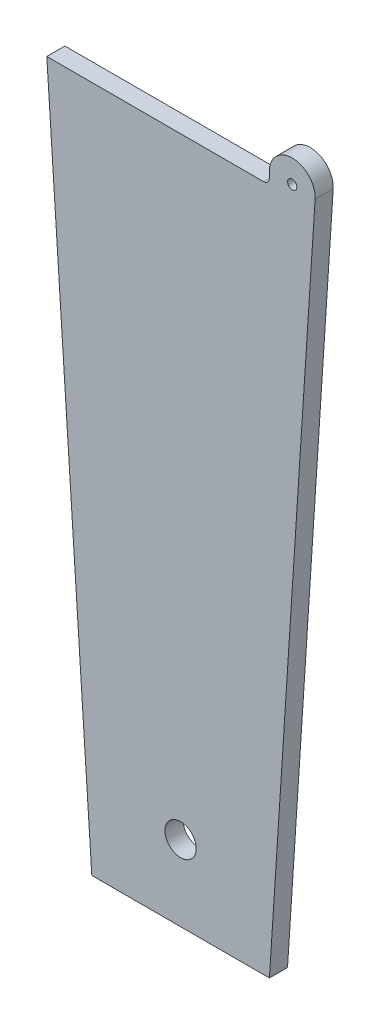
ISO-10303-21;
HEADER;
FILE_DESCRIPTION(('STEP AP214'),'2;1');
FILE_NAME('part.step','',(''),(''),'','','');
FILE_SCHEMA(('AUTOMOTIVE_DESIGN { 1 0 10303 214 1 1 1 1 }'));
ENDSEC;
DATA;
#1=APPLICATION_CONTEXT('core data for automotive mechanical design processes');
#2=APPLICATION_PROTOCOL_DEFINITION('international standard','automotive_design',2000,#1);
#3=PRODUCT_CONTEXT('',#1,'mechanical');
#4=PRODUCT('Part','Part','',(#3));
#5=PRODUCT_RELATED_PRODUCT_CATEGORY('part','',(#4));
#6=PRODUCT_DEFINITION_FORMATION('','',#4);
#7=PRODUCT_DEFINITION_CONTEXT('part definition',#1,'design');
#8=PRODUCT_DEFINITION('design','',#6,#7);
#9=PRODUCT_DEFINITION_SHAPE('','',#8);
#10=(LENGTH_UNIT() NAMED_UNIT(*) SI_UNIT(.MILLI.,.METRE.));
#11=(NAMED_UNIT(*) PLANE_ANGLE_UNIT() SI_UNIT($,.RADIAN.));
#12=(NAMED_UNIT(*) SI_UNIT($,.STERADIAN.) SOLID_ANGLE_UNIT());
#13=UNCERTAINTY_MEASURE_WITH_UNIT(LENGTH_MEASURE(1.E-05),#10,'distance_accuracy_value','');
#14=(GEOMETRIC_REPRESENTATION_CONTEXT(3) GLOBAL_UNCERTAINTY_ASSIGNED_CONTEXT((#13)) GLOBAL_UNIT_ASSIGNED_CONTEXT((#10,
#11,#12)) REPRESENTATION_CONTEXT('',''));
#15=CARTESIAN_POINT('',(0.,0.,0.));
#16=DIRECTION('',(0.,0.,1.));
#17=DIRECTION('',(1.,0.,0.));
#18=AXIS2_PLACEMENT_3D('',#15,#16,#17);
#19=CARTESIAN_POINT('',(-11.5356735336621,94.2,1.56));
#20=DIRECTION('',(0.,-1.,0.));
#21=DIRECTION('',(0.,0.,-1.));
#22=AXIS2_PLACEMENT_3D('',#19,#20,#21);
#23=PLANE('',#22);
#24=DIRECTION('',(-1.,0.,0.));
#25=VECTOR('',#24,1.);
#26=CARTESIAN_POINT('',(-11.5356735336621,94.2,1.56));
#27=LINE('',#26,#25);
#28=CARTESIAN_POINT('',(7.14660728296669,94.2,1.56));
#29=VERTEX_POINT('',#28);
#30=CARTESIAN_POINT('',(-11.5356735336621,94.2,1.56));
#31=VERTEX_POINT('',#30);
#32=EDGE_CURVE('E99',#29,#31,#27,.T.);
#33=ORIENTED_EDGE('',*,*,#32,.F.);
#34=DIRECTION('',(0.,0.,1.));
#35=VECTOR('',#34,1.);
#36=CARTESIAN_POINT('',(7.14660728296669,94.2,1.56));
#37=LINE('',#36,#35);
#38=CARTESIAN_POINT('',(7.14660728296669,94.2,0.));
#39=VERTEX_POINT('',#38);
#40=EDGE_CURVE('E53',#29,#39,#37,.F.);
#41=ORIENTED_EDGE('',*,*,#40,.T.);
#42=DIRECTION('',(-1.,0.,0.));
#43=VECTOR('',#42,1.);
#44=CARTESIAN_POINT('',(-11.5356735336621,94.2,0.));
#45=LINE('',#44,#43);
#46=CARTESIAN_POINT('',(-11.5356735336621,94.2,0.));
#47=VERTEX_POINT('',#46);
#48=EDGE_CURVE('E141',#39,#47,#45,.T.);
#49=ORIENTED_EDGE('',*,*,#48,.T.);
#50=DIRECTION('',(0.,0.,-1.));
#51=VECTOR('',#50,1.);
#52=CARTESIAN_POINT('',(-11.5356735336621,94.2,1.56));
#53=LINE('',#52,#51);
#54=EDGE_CURVE('E146',#31,#47,#53,.T.);
#55=ORIENTED_EDGE('',*,*,#54,.F.);
#56=EDGE_LOOP('',(#33,#41,#49,#55));
#57=FACE_BOUND('',#56,.T.);
#58=ADVANCED_FACE('F32',(#57),#23,.F.);
#59=CARTESIAN_POINT('',(11.5356735336621,94.2,1.56));
#60=DIRECTION('',(-0.997858923238604,0.0654031292301436,0.));
#61=DIRECTION('',(-0.0654031292301436,-0.997858923238604,0.));
#62=AXIS2_PLACEMENT_3D('',#59,#60,#61);
#63=PLANE('',#62);
#64=DIRECTION('',(0.0654031292301436,0.997858923238604,0.));
#65=VECTOR('',#64,1.);
#66=CARTESIAN_POINT('',(11.5356735336621,94.2,0.));
#67=LINE('',#66,#65);
#68=CARTESIAN_POINT('',(7.655500535,35.,0.));
#69=VERTEX_POINT('',#68);
#70=CARTESIAN_POINT('',(11.5943213544013,95.0947928324216,0.));
#71=VERTEX_POINT('',#70);
#72=EDGE_CURVE('E106',#69,#71,#67,.T.);
#73=ORIENTED_EDGE('',*,*,#72,.T.);
#74=DIRECTION('',(0.,0.,1.));
#75=VECTOR('',#74,1.);
#76=CARTESIAN_POINT('',(11.5943213544013,95.0947928324216,-4.96163960240657));
#77=LINE('',#76,#75);
#78=CARTESIAN_POINT('',(11.5943213544013,95.0947928324216,1.56));
#79=VERTEX_POINT('',#78);
#80=EDGE_CURVE('E103',#71,#79,#77,.T.);
#81=ORIENTED_EDGE('',*,*,#80,.T.);
#82=DIRECTION('',(0.0654031292301436,0.997858923238604,0.));
#83=VECTOR('',#82,1.);
#84=CARTESIAN_POINT('',(11.5356735336621,94.2,1.56));
#85=LINE('',#84,#83);
#86=CARTESIAN_POINT('',(7.655500535,35.,1.56));
#87=VERTEX_POINT('',#86);
#88=EDGE_CURVE('E88',#87,#79,#85,.T.);
#89=ORIENTED_EDGE('',*,*,#88,.F.);
#90=DIRECTION('',(0.,0.,-1.));
#91=VECTOR('',#90,1.);
#92=CARTESIAN_POINT('',(7.655500535,35.,1.56));
#93=LINE('',#92,#91);
#94=EDGE_CURVE('E161',#87,#69,#93,.T.);
#95=ORIENTED_EDGE('',*,*,#94,.T.);
#96=EDGE_LOOP('',(#73,#81,#89,#95));
#97=FACE_BOUND('',#96,.T.);
#98=ADVANCED_FACE('F104',(#97),#63,.F.);
#99=CARTESIAN_POINT('',(-11.5356735336621,94.2,1.56));
#100=DIRECTION('',(0.997858923238604,0.0654031292301436,0.));
#101=DIRECTION('',(-0.0654031292301436,0.997858923238604,0.));
#102=AXIS2_PLACEMENT_3D('',#99,#100,#101);
#103=PLANE('',#102);
#104=DIRECTION('',(0.0654031292301436,-0.997858923238604,0.));
#105=VECTOR('',#104,1.);
#106=CARTESIAN_POINT('',(-11.5356735336621,94.2,0.));
#107=LINE('',#106,#105);
#108=CARTESIAN_POINT('',(-7.655500535,35.,0.));
#109=VERTEX_POINT('',#108);
#110=EDGE_CURVE('E164',#47,#109,#107,.T.);
#111=ORIENTED_EDGE('',*,*,#110,.T.);
#112=DIRECTION('',(0.,0.,-1.));
#113=VECTOR('',#112,1.);
#114=CARTESIAN_POINT('',(-7.655500535,35.,1.56));
#115=LINE('',#114,#113);
#116=CARTESIAN_POINT('',(-7.655500535,35.,1.56));
#117=VERTEX_POINT('',#116);
#118=EDGE_CURVE('E151',#117,#109,#115,.T.);
#119=ORIENTED_EDGE('',*,*,#118,.F.);
#120=DIRECTION('',(0.0654031292301436,-0.997858923238604,0.));
#121=VECTOR('',#120,1.);
#122=CARTESIAN_POINT('',(-11.5356735336621,94.2,1.56));
#123=LINE('',#122,#121);
#124=EDGE_CURVE('E136',#31,#117,#123,.T.);
#125=ORIENTED_EDGE('',*,*,#124,.F.);
#126=ORIENTED_EDGE('',*,*,#54,.T.);
#127=EDGE_LOOP('',(#111,#119,#125,#126));
#128=FACE_BOUND('',#127,.T.);
#129=ADVANCED_FACE('F171',(#128),#103,.F.);
#130=CARTESIAN_POINT('',(-7.655500535,35.,1.56));
#131=DIRECTION('',(0.,1.,0.));
#132=DIRECTION('',(0.,0.,1.));
#133=AXIS2_PLACEMENT_3D('',#130,#131,#132);
#134=PLANE('',#133);
#135=DIRECTION('',(1.,0.,0.));
#136=VECTOR('',#135,1.);
#137=CARTESIAN_POINT('',(-7.655500535,35.,0.));
#138=LINE('',#137,#136);
#139=EDGE_CURVE('E100',#109,#69,#138,.T.);
#140=ORIENTED_EDGE('',*,*,#139,.T.);
#141=ORIENTED_EDGE('',*,*,#94,.F.);
#142=DIRECTION('',(1.,0.,0.));
#143=VECTOR('',#142,1.);
#144=CARTESIAN_POINT('',(-7.655500535,35.,1.56));
#145=LINE('',#144,#143);
#146=EDGE_CURVE('E95',#117,#87,#145,.T.);
#147=ORIENTED_EDGE('',*,*,#146,.F.);
#148=ORIENTED_EDGE('',*,*,#118,.T.);
#149=EDGE_LOOP('',(#140,#141,#147,#148));
#150=FACE_BOUND('',#149,.T.);
#151=ADVANCED_FACE('F175',(#150),#134,.F.);
#152=CARTESIAN_POINT('',(7.655500535,35.,1.56));
#153=DIRECTION('',(0.,0.,1.));
#154=DIRECTION('',(1.,0.,0.));
#155=AXIS2_PLACEMENT_3D('',#152,#153,#154);
#156=PLANE('',#155);
#157=CARTESIAN_POINT('',(0.,41.5,1.56));
#158=DIRECTION('',(0.,0.,1.));
#159=DIRECTION('',(1.,0.,0.));
#160=AXIS2_PLACEMENT_3D('',#157,#158,#159);
#161=CIRCLE('',#160,1.34620000000001);
#162=CARTESIAN_POINT('',(1.34620000000001,41.5,1.56));
#163=VERTEX_POINT('',#162);
#164=EDGE_CURVE('E127',#163,#163,#161,.T.);
#165=ORIENTED_EDGE('',*,*,#164,.F.);
#166=EDGE_LOOP('',(#165));
#167=FACE_BOUND('',#166,.T.);
#168=ORIENTED_EDGE('',*,*,#88,.T.);
#169=CARTESIAN_POINT('',(9.62257967296669,95.22402761,1.56));
#170=DIRECTION('',(0.,0.,1.));
#171=DIRECTION('',(1.,0.,0.));
#172=AXIS2_PLACEMENT_3D('',#169,#170,#171);
#173=CIRCLE('',#172,1.97597239);
#174=CARTESIAN_POINT('',(7.64660728296669,95.22402761,1.56));
#175=VERTEX_POINT('',#174);
#176=EDGE_CURVE('E93',#79,#175,#173,.T.);
#177=ORIENTED_EDGE('',*,*,#176,.T.);
#178=DIRECTION('',(0.,-1.,0.));
#179=VECTOR('',#178,1.);
#180=CARTESIAN_POINT('',(7.64660728296669,95.22402761,1.56));
#181=LINE('',#180,#179);
#182=CARTESIAN_POINT('',(7.64660728296669,94.7,1.56));
#183=VERTEX_POINT('',#182);
#184=EDGE_CURVE('E115',#175,#183,#181,.T.);
#185=ORIENTED_EDGE('',*,*,#184,.T.);
#186=CARTESIAN_POINT('',(7.14660728296669,94.7,1.56));
#187=DIRECTION('',(0.,0.,1.));
#188=DIRECTION('',(1.,0.,0.));
#189=AXIS2_PLACEMENT_3D('',#186,#187,#188);
#190=CIRCLE('',#189,0.5);
#191=EDGE_CURVE('E40',#183,#29,#190,.F.);
#192=ORIENTED_EDGE('',*,*,#191,.T.);
#193=ORIENTED_EDGE('',*,*,#32,.T.);
#194=ORIENTED_EDGE('',*,*,#124,.T.);
#195=ORIENTED_EDGE('',*,*,#146,.T.);
#196=EDGE_LOOP('',(#168,#177,#185,#192,#193,#194,#195));
#197=FACE_BOUND('',#196,.T.);
#198=CARTESIAN_POINT('',(9.62257967296669,95.22402761,1.56));
#199=DIRECTION('',(0.,0.,1.));
#200=DIRECTION('',(1.,0.,0.));
#201=AXIS2_PLACEMENT_3D('',#198,#199,#200);
#202=CIRCLE('',#201,0.396875);
#203=CARTESIAN_POINT('',(10.0194546729667,95.22402761,1.56));
#204=VERTEX_POINT('',#203);
#205=EDGE_CURVE('E117',#204,#204,#202,.T.);
#206=ORIENTED_EDGE('',*,*,#205,.F.);
#207=EDGE_LOOP('',(#206));
#208=FACE_BOUND('',#207,.T.);
#209=ADVANCED_FACE('F90',(#167,#197,#208),#156,.T.);
#210=CARTESIAN_POINT('',(7.655500535,35.,0.));
#211=DIRECTION('',(0.,0.,1.));
#212=DIRECTION('',(1.,0.,0.));
#213=AXIS2_PLACEMENT_3D('',#210,#211,#212);
#214=PLANE('',#213);
#215=CARTESIAN_POINT('',(0.,41.5,0.));
#216=DIRECTION('',(0.,0.,1.));
#217=DIRECTION('',(1.,0.,0.));
#218=AXIS2_PLACEMENT_3D('',#215,#216,#217);
#219=CIRCLE('',#218,1.34620000000001);
#220=CARTESIAN_POINT('',(1.34620000000001,41.5,0.));
#221=VERTEX_POINT('',#220);
#222=EDGE_CURVE('E129',#221,#221,#219,.T.);
#223=ORIENTED_EDGE('',*,*,#222,.T.);
#224=EDGE_LOOP('',(#223));
#225=FACE_BOUND('',#224,.T.);
#226=ORIENTED_EDGE('',*,*,#72,.F.);
#227=ORIENTED_EDGE('',*,*,#139,.F.);
#228=ORIENTED_EDGE('',*,*,#110,.F.);
#229=ORIENTED_EDGE('',*,*,#48,.F.);
#230=CARTESIAN_POINT('',(7.14660728296669,94.7,0.));
#231=DIRECTION('',(0.,0.,1.));
#232=DIRECTION('',(1.,0.,0.));
#233=AXIS2_PLACEMENT_3D('',#230,#231,#232);
#234=CIRCLE('',#233,0.5);
#235=CARTESIAN_POINT('',(7.64660728296669,94.7,0.));
#236=VERTEX_POINT('',#235);
#237=EDGE_CURVE('E11',#39,#236,#234,.T.);
#238=ORIENTED_EDGE('',*,*,#237,.T.);
#239=DIRECTION('',(0.,1.,0.));
#240=VECTOR('',#239,1.);
#241=CARTESIAN_POINT('',(7.64660728296669,95.22402761,0.));
#242=LINE('',#241,#240);
#243=CARTESIAN_POINT('',(7.64660728296669,95.22402761,0.));
#244=VERTEX_POINT('',#243);
#245=EDGE_CURVE('E128',#236,#244,#242,.T.);
#246=ORIENTED_EDGE('',*,*,#245,.T.);
#247=CARTESIAN_POINT('',(9.62257967296669,95.22402761,0.));
#248=DIRECTION('',(0.,0.,1.));
#249=DIRECTION('',(1.,0.,0.));
#250=AXIS2_PLACEMENT_3D('',#247,#248,#249);
#251=CIRCLE('',#250,1.97597239);
#252=EDGE_CURVE('E122',#244,#71,#251,.F.);
#253=ORIENTED_EDGE('',*,*,#252,.T.);
#254=EDGE_LOOP('',(#226,#227,#228,#229,#238,#246,#253));
#255=FACE_BOUND('',#254,.T.);
#256=CARTESIAN_POINT('',(9.62257967296669,95.22402761,0.));
#257=DIRECTION('',(0.,0.,1.));
#258=DIRECTION('',(1.,0.,0.));
#259=AXIS2_PLACEMENT_3D('',#256,#257,#258);
#260=CIRCLE('',#259,0.396875);
#261=CARTESIAN_POINT('',(10.0194546729667,95.22402761,0.));
#262=VERTEX_POINT('',#261);
#263=EDGE_CURVE('E124',#262,#262,#260,.F.);
#264=ORIENTED_EDGE('',*,*,#263,.F.);
#265=EDGE_LOOP('',(#264));
#266=FACE_BOUND('',#265,.T.);
#267=ADVANCED_FACE('F177',(#225,#255,#266),#214,.F.);
#268=CARTESIAN_POINT('',(0.,41.5,0.));
#269=DIRECTION('',(0.,0.,1.));
#270=DIRECTION('',(1.,0.,0.));
#271=AXIS2_PLACEMENT_3D('',#268,#269,#270);
#272=CYLINDRICAL_SURFACE('',#271,1.34620000000001);
#273=ORIENTED_EDGE('',*,*,#222,.F.);
#274=EDGE_LOOP('',(#273));
#275=FACE_BOUND('',#274,.T.);
#276=ORIENTED_EDGE('',*,*,#164,.T.);
#277=EDGE_LOOP('',(#276));
#278=FACE_BOUND('',#277,.T.);
#279=ADVANCED_FACE('F194',(#275,#278),#272,.F.);
#280=CARTESIAN_POINT('',(9.62257967296669,95.22402761,-4.96163960240657));
#281=DIRECTION('',(0.,0.,1.));
#282=DIRECTION('',(1.,0.,0.));
#283=AXIS2_PLACEMENT_3D('',#280,#281,#282);
#284=CYLINDRICAL_SURFACE('',#283,1.97597239);
#285=ORIENTED_EDGE('',*,*,#252,.F.);
#286=DIRECTION('',(0.,0.,1.));
#287=VECTOR('',#286,1.);
#288=CARTESIAN_POINT('',(7.64660728296669,95.22402761,-4.96163960240657));
#289=LINE('',#288,#287);
#290=EDGE_CURVE('E110',#244,#175,#289,.T.);
#291=ORIENTED_EDGE('',*,*,#290,.T.);
#292=ORIENTED_EDGE('',*,*,#176,.F.);
#293=ORIENTED_EDGE('',*,*,#80,.F.);
#294=EDGE_LOOP('',(#285,#291,#292,#293));
#295=FACE_BOUND('',#294,.T.);
#296=ADVANCED_FACE('F112',(#295),#284,.T.);
#297=CARTESIAN_POINT('',(7.64660728296669,95.22402761,-4.96163960240657));
#298=DIRECTION('',(-1.,0.,0.));
#299=DIRECTION('',(0.,0.,1.));
#300=AXIS2_PLACEMENT_3D('',#297,#298,#299);
#301=PLANE('',#300);
#302=ORIENTED_EDGE('',*,*,#245,.F.);
#303=DIRECTION('',(0.,0.,1.));
#304=VECTOR('',#303,1.);
#305=CARTESIAN_POINT('',(7.64660728296669,94.7,-4.96163960240657));
#306=LINE('',#305,#304);
#307=EDGE_CURVE('E144',#236,#183,#306,.T.);
#308=ORIENTED_EDGE('',*,*,#307,.T.);
#309=ORIENTED_EDGE('',*,*,#184,.F.);
#310=ORIENTED_EDGE('',*,*,#290,.F.);
#311=EDGE_LOOP('',(#302,#308,#309,#310));
#312=FACE_BOUND('',#311,.T.);
#313=ADVANCED_FACE('F179',(#312),#301,.T.);
#314=CARTESIAN_POINT('',(9.62257967296669,95.22402761,-4.96163960240657));
#315=DIRECTION('',(0.,0.,1.));
#316=DIRECTION('',(1.,0.,0.));
#317=AXIS2_PLACEMENT_3D('',#314,#315,#316);
#318=CYLINDRICAL_SURFACE('',#317,0.396875);
#319=ORIENTED_EDGE('',*,*,#263,.T.);
#320=EDGE_LOOP('',(#319));
#321=FACE_BOUND('',#320,.T.);
#322=ORIENTED_EDGE('',*,*,#205,.T.);
#323=EDGE_LOOP('',(#322));
#324=FACE_BOUND('',#323,.T.);
#325=ADVANCED_FACE('F204',(#321,#324),#318,.F.);
#326=CARTESIAN_POINT('',(7.14660728296669,94.7,-4.96163960240657));
#327=DIRECTION('',(0.,0.,1.));
#328=DIRECTION('',(1.,0.,0.));
#329=AXIS2_PLACEMENT_3D('',#326,#327,#328);
#330=CYLINDRICAL_SURFACE('',#329,0.5);
#331=ORIENTED_EDGE('',*,*,#237,.F.);
#332=ORIENTED_EDGE('',*,*,#40,.F.);
#333=ORIENTED_EDGE('',*,*,#191,.F.);
#334=ORIENTED_EDGE('',*,*,#307,.F.);
#335=EDGE_LOOP('',(#331,#332,#333,#334));
#336=FACE_BOUND('',#335,.T.);
#337=ADVANCED_FACE('F34',(#336),#330,.F.);
#338=CLOSED_SHELL('',(#58,#98,#129,#151,#209,#267,#279,#296,#313,#325,#337));
#339=MANIFOLD_SOLID_BREP('B2',#338);
#340=ADVANCED_BREP_SHAPE_REPRESENTATION('',(#18,#339),#14);
#341=SHAPE_DEFINITION_REPRESENTATION(#9,#340);
ENDSEC;
END-ISO-10303-21;
